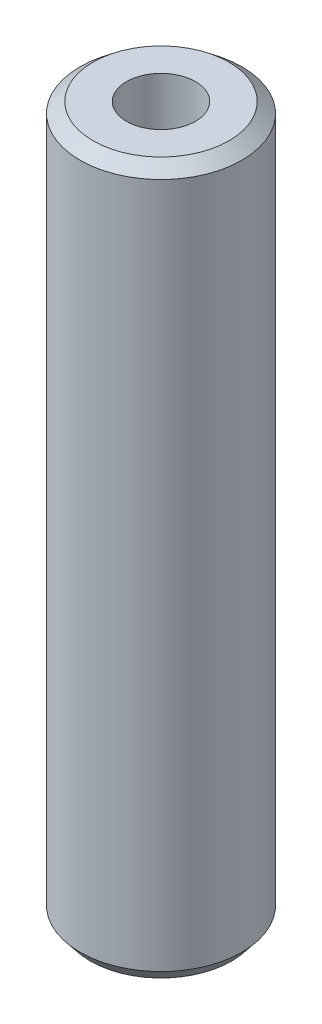
ISO-10303-21;
HEADER;
FILE_DESCRIPTION(('STEP AP214'),'2;1');
FILE_NAME('part.step','',(''),(''),'','','');
FILE_SCHEMA(('AUTOMOTIVE_DESIGN { 1 0 10303 214 1 1 1 1 }'));
ENDSEC;
DATA;
#1=APPLICATION_CONTEXT('core data for automotive mechanical design processes');
#2=APPLICATION_PROTOCOL_DEFINITION('international standard','automotive_design',2000,#1);
#3=PRODUCT_CONTEXT('',#1,'mechanical');
#4=PRODUCT('Part','Part','',(#3));
#5=PRODUCT_RELATED_PRODUCT_CATEGORY('part','',(#4));
#6=PRODUCT_DEFINITION_FORMATION('','',#4);
#7=PRODUCT_DEFINITION_CONTEXT('part definition',#1,'design');
#8=PRODUCT_DEFINITION('design','',#6,#7);
#9=PRODUCT_DEFINITION_SHAPE('','',#8);
#10=(LENGTH_UNIT() NAMED_UNIT(*) SI_UNIT(.MILLI.,.METRE.));
#11=(NAMED_UNIT(*) PLANE_ANGLE_UNIT() SI_UNIT($,.RADIAN.));
#12=(NAMED_UNIT(*) SI_UNIT($,.STERADIAN.) SOLID_ANGLE_UNIT());
#13=UNCERTAINTY_MEASURE_WITH_UNIT(LENGTH_MEASURE(1.E-05),#10,'distance_accuracy_value','');
#14=(GEOMETRIC_REPRESENTATION_CONTEXT(3) GLOBAL_UNCERTAINTY_ASSIGNED_CONTEXT((#13)) GLOBAL_UNIT_ASSIGNED_CONTEXT((#10,
#11,#12)) REPRESENTATION_CONTEXT('',''));
#15=CARTESIAN_POINT('',(0.,0.,0.));
#16=DIRECTION('',(0.,0.,1.));
#17=DIRECTION('',(1.,0.,0.));
#18=AXIS2_PLACEMENT_3D('',#15,#16,#17);
#19=CARTESIAN_POINT('',(0.,240.820918368848,0.));
#20=DIRECTION('',(0.,-1.,0.));
#21=DIRECTION('',(0.,0.,-1.));
#22=AXIS2_PLACEMENT_3D('',#19,#20,#21);
#23=CYLINDRICAL_SURFACE('',#22,27.5);
#24=CARTESIAN_POINT('',(0.,237.294498348299,0.));
#25=DIRECTION('',(0.,1.,0.));
#26=DIRECTION('',(0.,0.,1.));
#27=AXIS2_PLACEMENT_3D('',#24,#25,#26);
#28=CIRCLE('',#27,27.5);
#29=CARTESIAN_POINT('',(0.,237.294498348299,-27.5));
#30=VERTEX_POINT('',#29);
#31=EDGE_CURVE('E50',#30,#30,#28,.F.);
#32=CARTESIAN_POINT('',(0.,4.39047023873562,0.));
#33=DIRECTION('',(0.,1.,0.));
#34=DIRECTION('',(0.,0.,1.));
#35=AXIS2_PLACEMENT_3D('',#32,#33,#34);
#36=CIRCLE('',#35,27.5);
#37=CARTESIAN_POINT('',(0.,4.39047023873559,-27.5));
#38=VERTEX_POINT('',#37);
#39=EDGE_CURVE('E51',#38,#38,#36,.T.);
#40=CARTESIAN_POINT('',(0.,237.294498348299,-27.5));
#41=CARTESIAN_POINT('',(0.,234.868414722158,-27.5));
#42=CARTESIAN_POINT('',(0.,232.442331096016,-27.5));
#43=CARTESIAN_POINT('',(0.,227.590163843734,-27.5));
#44=CARTESIAN_POINT('',(0.,225.164080217592,-27.5));
#45=CARTESIAN_POINT('',(0.,220.31191296531,-27.5));
#46=CARTESIAN_POINT('',(0.,217.885829339169,-27.5));
#47=CARTESIAN_POINT('',(0.,213.033662086886,-27.5));
#48=CARTESIAN_POINT('',(0.,210.607578460745,-27.5));
#49=CARTESIAN_POINT('',(0.,205.755411208462,-27.5));
#50=CARTESIAN_POINT('',(0.,203.329327582321,-27.5));
#51=CARTESIAN_POINT('',(0.,198.477160330038,-27.5));
#52=CARTESIAN_POINT('',(0.,196.051076703897,-27.5));
#53=CARTESIAN_POINT('',(0.,191.198909451614,-27.5));
#54=CARTESIAN_POINT('',(0.,188.772825825473,-27.5));
#55=CARTESIAN_POINT('',(0.,183.920658573191,-27.5));
#56=CARTESIAN_POINT('',(0.,181.494574947049,-27.5));
#57=CARTESIAN_POINT('',(0.,176.642407694767,-27.5));
#58=CARTESIAN_POINT('',(0.,174.216324068625,-27.5));
#59=CARTESIAN_POINT('',(0.,169.364156816343,-27.5));
#60=CARTESIAN_POINT('',(0.,166.938073190202,-27.5));
#61=CARTESIAN_POINT('',(0.,162.085905937919,-27.5));
#62=CARTESIAN_POINT('',(0.,159.659822311778,-27.5));
#63=CARTESIAN_POINT('',(0.,154.807655059495,-27.5));
#64=CARTESIAN_POINT('',(0.,152.381571433354,-27.5));
#65=CARTESIAN_POINT('',(0.,147.529404181071,-27.5));
#66=CARTESIAN_POINT('',(0.,145.10332055493,-27.5));
#67=CARTESIAN_POINT('',(0.,140.251153302648,-27.5));
#68=CARTESIAN_POINT('',(0.,137.825069676506,-27.5));
#69=CARTESIAN_POINT('',(0.,132.972902424224,-27.5));
#70=CARTESIAN_POINT('',(0.,130.546818798082,-27.5));
#71=CARTESIAN_POINT('',(0.,125.6946515458,-27.5));
#72=CARTESIAN_POINT('',(0.,123.268567919658,-27.5));
#73=CARTESIAN_POINT('',(0.,118.416400667376,-27.5));
#74=CARTESIAN_POINT('',(0.,115.990317041235,-27.5));
#75=CARTESIAN_POINT('',(0.,111.138149788952,-27.5));
#76=CARTESIAN_POINT('',(0.,108.712066162811,-27.5));
#77=CARTESIAN_POINT('',(0.,103.859898910528,-27.5));
#78=CARTESIAN_POINT('',(0.,101.433815284387,-27.5));
#79=CARTESIAN_POINT('',(0.,96.5816480321044,-27.5));
#80=CARTESIAN_POINT('',(0.,94.1555644059631,-27.5));
#81=CARTESIAN_POINT('',(0.,89.3033971536805,-27.5));
#82=CARTESIAN_POINT('',(0.,86.8773135275393,-27.5));
#83=CARTESIAN_POINT('',(0.,82.0251462752567,-27.5));
#84=CARTESIAN_POINT('',(0.,79.5990626491154,-27.5));
#85=CARTESIAN_POINT('',(0.,74.7468953968328,-27.5));
#86=CARTESIAN_POINT('',(0.,72.3208117706915,-27.5));
#87=CARTESIAN_POINT('',(0.,67.468644518409,-27.5));
#88=CARTESIAN_POINT('',(0.,65.0425608922677,-27.5));
#89=CARTESIAN_POINT('',(0.,60.1903936399851,-27.5));
#90=CARTESIAN_POINT('',(0.,57.7643100138438,-27.5));
#91=CARTESIAN_POINT('',(0.,52.9121427615613,-27.5));
#92=CARTESIAN_POINT('',(0.,50.48605913542,-27.5));
#93=CARTESIAN_POINT('',(0.,45.6338918831374,-27.5));
#94=CARTESIAN_POINT('',(0.,43.2078082569961,-27.5));
#95=CARTESIAN_POINT('',(0.,38.3556410047136,-27.5));
#96=CARTESIAN_POINT('',(0.,35.9295573785723,-27.5));
#97=CARTESIAN_POINT('',(0.,31.0773901262897,-27.5));
#98=CARTESIAN_POINT('',(0.,28.6513065001484,-27.5));
#99=CARTESIAN_POINT('',(0.,23.7991392478659,-27.5));
#100=CARTESIAN_POINT('',(0.,21.3730556217246,-27.5));
#101=CARTESIAN_POINT('',(0.,16.520888369442,-27.5));
#102=CARTESIAN_POINT('',(0.,14.0948047433007,-27.5));
#103=CARTESIAN_POINT('',(0.,9.24263749101816,-27.5));
#104=CARTESIAN_POINT('',(0.,6.81655386487687,-27.5));
#105=CARTESIAN_POINT('',(0.,4.39047023873559,-27.5));
#106=B_SPLINE_CURVE_WITH_KNOTS('',3,(#40,#41,#42,#43,#44,#45,#46,#47,#48,#49,#50,#51,#52,#53,
#54,#55,#56,#57,#58,#59,#60,#61,#62,#63,#64,#65,#66,#67,#68,#69,#70,#71,#72,#73,#74,#75,#76,#77,
#78,#79,#80,#81,#82,#83,#84,#85,#86,#87,#88,#89,#90,#91,#92,#93,#94,#95,#96,#97,#98,#99,#100,
#101,#102,#103,#104,#105),.UNSPECIFIED.,.F.,.F.,(4,2,2,2,2,2,2,2,2,2,2,2,2,2,2,2,2,2,2,2,2,2,2,
2,2,2,2,2,2,2,2,2,4),(0.,7.27825087842385,14.5565017568477,21.8347526352715,29.1130035136954,
36.3912543921192,43.6695052705431,50.9477561489669,58.2260070273908,65.5042579058146,
72.7825087842385,80.0607596626623,87.3390105410862,94.61726141951,101.895512297934,
109.173763176358,116.452014054782,123.730264933205,131.008515811629,138.286766690053,
145.565017568477,152.843268446901,160.121519325325,167.399770203749,174.678021082172,
181.956271960596,189.23452283902,196.512773717444,203.791024595868,211.069275474292,
218.347526352716,225.625777231139,232.904028109563),.UNSPECIFIED.);
#107=EDGE_CURVE('BSEAM39',#30,#38,#106,.T.);
#108=ORIENTED_EDGE('',*,*,#31,.T.);
#109=ORIENTED_EDGE('',*,*,#39,.T.);
#110=ORIENTED_EDGE('',*,*,#107,.T.);
#111=ORIENTED_EDGE('',*,*,#107,.F.);
#112=EDGE_LOOP('',(#108,#110,#109,#111));
#113=FACE_BOUND('',#112,.T.);
#114=ADVANCED_FACE('F39',(#113),#23,.T.);
#115=CARTESIAN_POINT('',(0.,240.820918368848,0.));
#116=DIRECTION('',(0.,1.,0.));
#117=DIRECTION('',(0.,0.,1.));
#118=AXIS2_PLACEMENT_3D('',#115,#116,#117);
#119=PLANE('',#118);
#120=CARTESIAN_POINT('',(0.,240.820918368848,0.));
#121=DIRECTION('',(0.,1.,0.));
#122=DIRECTION('',(0.,0.,1.));
#123=AXIS2_PLACEMENT_3D('',#120,#121,#122);
#124=CIRCLE('',#123,23.1095297612648);
#125=CARTESIAN_POINT('',(0.,240.820918368848,23.1095297612648));
#126=VERTEX_POINT('',#125);
#127=EDGE_CURVE('E54',#126,#126,#124,.T.);
#128=ORIENTED_EDGE('',*,*,#127,.T.);
#129=EDGE_LOOP('',(#128));
#130=FACE_BOUND('',#129,.T.);
#131=CARTESIAN_POINT('',(0.,240.820918368848,0.));
#132=DIRECTION('',(0.,1.,0.));
#133=DIRECTION('',(0.,0.,1.));
#134=AXIS2_PLACEMENT_3D('',#131,#132,#133);
#135=CIRCLE('',#134,11.706873025203);
#136=CARTESIAN_POINT('',(0.,240.820918368847,-11.706873025203));
#137=VERTEX_POINT('',#136);
#138=EDGE_CURVE('E58',#137,#137,#135,.T.);
#139=ORIENTED_EDGE('',*,*,#138,.F.);
#140=EDGE_LOOP('',(#139));
#141=FACE_BOUND('',#140,.T.);
#142=ADVANCED_FACE('F69',(#130,#141),#119,.T.);
#143=CARTESIAN_POINT('',(0.,0.,0.));
#144=DIRECTION('',(0.,1.,0.));
#145=DIRECTION('',(0.,0.,1.));
#146=AXIS2_PLACEMENT_3D('',#143,#144,#145);
#147=PLANE('',#146);
#148=CARTESIAN_POINT('',(0.,0.,0.));
#149=DIRECTION('',(0.,1.,0.));
#150=DIRECTION('',(0.,0.,1.));
#151=AXIS2_PLACEMENT_3D('',#148,#149,#150);
#152=CIRCLE('',#151,23.9735799794511);
#153=CARTESIAN_POINT('',(0.,0.,23.9735799794511));
#154=VERTEX_POINT('',#153);
#155=EDGE_CURVE('E10',#154,#154,#152,.F.);
#156=ORIENTED_EDGE('',*,*,#155,.T.);
#157=EDGE_LOOP('',(#156));
#158=FACE_BOUND('',#157,.T.);
#159=CARTESIAN_POINT('',(0.,0.,0.));
#160=DIRECTION('',(0.,1.,0.));
#161=DIRECTION('',(0.,0.,1.));
#162=AXIS2_PLACEMENT_3D('',#159,#160,#161);
#163=CIRCLE('',#162,11.706873025203);
#164=CARTESIAN_POINT('',(0.,0.,-11.706873025203));
#165=VERTEX_POINT('',#164);
#166=EDGE_CURVE('E63',#165,#165,#163,.T.);
#167=ORIENTED_EDGE('',*,*,#166,.T.);
#168=EDGE_LOOP('',(#167));
#169=FACE_BOUND('',#168,.T.);
#170=ADVANCED_FACE('F75',(#158,#169),#147,.F.);
#171=CARTESIAN_POINT('',(0.,240.820918368848,0.));
#172=DIRECTION('',(0.,-1.,0.));
#173=DIRECTION('',(0.,0.,-1.));
#174=AXIS2_PLACEMENT_3D('',#171,#172,#173);
#175=CYLINDRICAL_SURFACE('',#174,11.706873025203);
#176=CARTESIAN_POINT('',(0.,240.820918368847,-11.706873025203));
#177=CARTESIAN_POINT('',(0.,238.312367135839,-11.706873025203));
#178=CARTESIAN_POINT('',(0.,235.80381590283,-11.706873025203));
#179=CARTESIAN_POINT('',(0.,230.786713436812,-11.706873025203));
#180=CARTESIAN_POINT('',(0.,228.278162203803,-11.706873025203));
#181=CARTESIAN_POINT('',(0.,223.261059737786,-11.706873025203));
#182=CARTESIAN_POINT('',(0.,220.752508504777,-11.706873025203));
#183=CARTESIAN_POINT('',(0.,215.735406038759,-11.706873025203));
#184=CARTESIAN_POINT('',(0.,213.22685480575,-11.706873025203));
#185=CARTESIAN_POINT('',(0.,208.209752339733,-11.706873025203));
#186=CARTESIAN_POINT('',(0.,205.701201106724,-11.706873025203));
#187=CARTESIAN_POINT('',(0.,200.684098640706,-11.706873025203));
#188=CARTESIAN_POINT('',(0.,198.175547407697,-11.706873025203));
#189=CARTESIAN_POINT('',(0.,193.15844494168,-11.706873025203));
#190=CARTESIAN_POINT('',(0.,190.649893708671,-11.706873025203));
#191=CARTESIAN_POINT('',(0.,185.632791242653,-11.706873025203));
#192=CARTESIAN_POINT('',(0.,183.124240009644,-11.706873025203));
#193=CARTESIAN_POINT('',(0.,178.107137543627,-11.706873025203));
#194=CARTESIAN_POINT('',(0.,175.598586310618,-11.706873025203));
#195=CARTESIAN_POINT('',(0.,170.5814838446,-11.706873025203));
#196=CARTESIAN_POINT('',(0.,168.072932611591,-11.706873025203));
#197=CARTESIAN_POINT('',(0.,163.055830145574,-11.706873025203));
#198=CARTESIAN_POINT('',(0.,160.547278912565,-11.706873025203));
#199=CARTESIAN_POINT('',(0.,155.530176446547,-11.706873025203));
#200=CARTESIAN_POINT('',(0.,153.021625213539,-11.706873025203));
#201=CARTESIAN_POINT('',(0.,148.004522747521,-11.706873025203));
#202=CARTESIAN_POINT('',(0.,145.495971514512,-11.706873025203));
#203=CARTESIAN_POINT('',(0.,140.478869048494,-11.706873025203));
#204=CARTESIAN_POINT('',(0.,137.970317815486,-11.706873025203));
#205=CARTESIAN_POINT('',(0.,132.953215349468,-11.706873025203));
#206=CARTESIAN_POINT('',(0.,130.444664116459,-11.706873025203));
#207=CARTESIAN_POINT('',(0.,125.427561650441,-11.706873025203));
#208=CARTESIAN_POINT('',(0.,122.919010417433,-11.706873025203));
#209=CARTESIAN_POINT('',(0.,117.901907951415,-11.706873025203));
#210=CARTESIAN_POINT('',(0.,115.393356718406,-11.706873025203));
#211=CARTESIAN_POINT('',(0.,110.376254252388,-11.706873025203));
#212=CARTESIAN_POINT('',(0.,107.86770301938,-11.706873025203));
#213=CARTESIAN_POINT('',(0.,102.850600553362,-11.706873025203));
#214=CARTESIAN_POINT('',(0.,100.342049320353,-11.706873025203));
#215=CARTESIAN_POINT('',(0.,95.3249468543355,-11.706873025203));
#216=CARTESIAN_POINT('',(0.,92.8163956213266,-11.706873025203));
#217=CARTESIAN_POINT('',(0.,87.799293155309,-11.706873025203));
#218=CARTESIAN_POINT('',(0.,85.2907419223001,-11.706873025203));
#219=CARTESIAN_POINT('',(0.,80.2736394562825,-11.706873025203));
#220=CARTESIAN_POINT('',(0.,77.7650882232737,-11.706873025203));
#221=CARTESIAN_POINT('',(0.,72.747985757256,-11.706873025203));
#222=CARTESIAN_POINT('',(0.,70.2394345242472,-11.706873025203));
#223=CARTESIAN_POINT('',(0.,65.2223320582295,-11.706873025203));
#224=CARTESIAN_POINT('',(0.,62.7137808252207,-11.706873025203));
#225=CARTESIAN_POINT('',(0.,57.696678359203,-11.706873025203));
#226=CARTESIAN_POINT('',(0.,55.1881271261942,-11.706873025203));
#227=CARTESIAN_POINT('',(0.,50.1710246601765,-11.706873025203));
#228=CARTESIAN_POINT('',(0.,47.6624734271677,-11.706873025203));
#229=CARTESIAN_POINT('',(0.,42.6453709611501,-11.706873025203));
#230=CARTESIAN_POINT('',(0.,40.1368197281412,-11.706873025203));
#231=CARTESIAN_POINT('',(0.,35.1197172621236,-11.706873025203));
#232=CARTESIAN_POINT('',(0.,32.6111660291147,-11.706873025203));
#233=CARTESIAN_POINT('',(0.,27.5940635630971,-11.706873025203));
#234=CARTESIAN_POINT('',(0.,25.0855123300883,-11.706873025203));
#235=CARTESIAN_POINT('',(0.,20.0684098640706,-11.706873025203));
#236=CARTESIAN_POINT('',(0.,17.5598586310618,-11.706873025203));
#237=CARTESIAN_POINT('',(0.,12.5427561650441,-11.706873025203));
#238=CARTESIAN_POINT('',(0.,10.0342049320353,-11.706873025203));
#239=CARTESIAN_POINT('',(0.,5.01710246601764,-11.706873025203));
#240=CARTESIAN_POINT('',(0.,2.5085512330088,-11.706873025203));
#241=CARTESIAN_POINT('',(0.,0.,-11.706873025203));
#242=B_SPLINE_CURVE_WITH_KNOTS('',3,(#176,#177,#178,#179,#180,#181,#182,#183,#184,#185,#186,
#187,#188,#189,#190,#191,#192,#193,#194,#195,#196,#197,#198,#199,#200,#201,#202,#203,#204,#205,
#206,#207,#208,#209,#210,#211,#212,#213,#214,#215,#216,#217,#218,#219,#220,#221,#222,#223,#224,
#225,#226,#227,#228,#229,#230,#231,#232,#233,#234,#235,#236,#237,#238,#239,#240,#241),
.UNSPECIFIED.,.F.,.F.,(4,2,2,2,2,2,2,2,2,2,2,2,2,2,2,2,2,2,2,2,2,2,2,2,2,2,2,2,2,2,2,2,4),(0.,
7.52565369902647,15.051307398053,22.5769610970794,30.1026147961059,37.6282684951324,
45.1539221941589,52.6795758931854,60.2052295922119,67.7308832912384,75.2565369902648,
82.7821906892913,90.3078443883178,97.8334980873443,105.359151786371,112.884805485397,
120.410459184424,127.93611288345,135.461766582477,142.987420281503,150.51307398053,
158.038727679556,165.564381378583,173.090035077609,180.615688776636,188.141342475662,
195.666996174689,203.192649873715,210.718303572742,218.243957271768,225.769610970795,
233.295264669821,240.820918368848),.UNSPECIFIED.);
#243=EDGE_CURVE('BSEAM70',#137,#165,#242,.T.);
#244=ORIENTED_EDGE('',*,*,#138,.T.);
#245=ORIENTED_EDGE('',*,*,#166,.F.);
#246=ORIENTED_EDGE('',*,*,#243,.T.);
#247=ORIENTED_EDGE('',*,*,#243,.F.);
#248=EDGE_LOOP('',(#244,#246,#245,#247));
#249=FACE_BOUND('',#248,.T.);
#250=ADVANCED_FACE('F70',(#249),#175,.F.);
#251=CARTESIAN_POINT('',(0.,240.820918368848,0.));
#252=DIRECTION('',(0.,-1.,0.));
#253=DIRECTION('',(0.,0.,-1.));
#254=AXIS2_PLACEMENT_3D('',#251,#252,#253);
#255=CONICAL_SURFACE('',#254,23.1095297612648,0.894107994307565);
#256=ORIENTED_EDGE('',*,*,#31,.F.);
#257=EDGE_LOOP('',(#256));
#258=FACE_BOUND('',#257,.T.);
#259=ORIENTED_EDGE('',*,*,#127,.F.);
#260=EDGE_LOOP('',(#259));
#261=FACE_BOUND('',#260,.T.);
#262=ADVANCED_FACE('F81',(#258,#261),#255,.T.);
#263=CARTESIAN_POINT('',(0.,4.39047023873562,0.));
#264=DIRECTION('',(0.,1.,0.));
#265=DIRECTION('',(0.,0.,1.));
#266=AXIS2_PLACEMENT_3D('',#263,#264,#265);
#267=CONICAL_SURFACE('',#266,27.5,0.676688332487327);
#268=ORIENTED_EDGE('',*,*,#155,.F.);
#269=EDGE_LOOP('',(#268));
#270=FACE_BOUND('',#269,.T.);
#271=ORIENTED_EDGE('',*,*,#39,.F.);
#272=EDGE_LOOP('',(#271));
#273=FACE_BOUND('',#272,.T.);
#274=ADVANCED_FACE('F45',(#270,#273),#267,.T.);
#275=CLOSED_SHELL('',(#114,#142,#170,#250,#262,#274));
#276=MANIFOLD_SOLID_BREP('B2',#275);
#277=ADVANCED_BREP_SHAPE_REPRESENTATION('',(#18,#276),#14);
#278=SHAPE_DEFINITION_REPRESENTATION(#9,#277);
ENDSEC;
END-ISO-10303-21;
